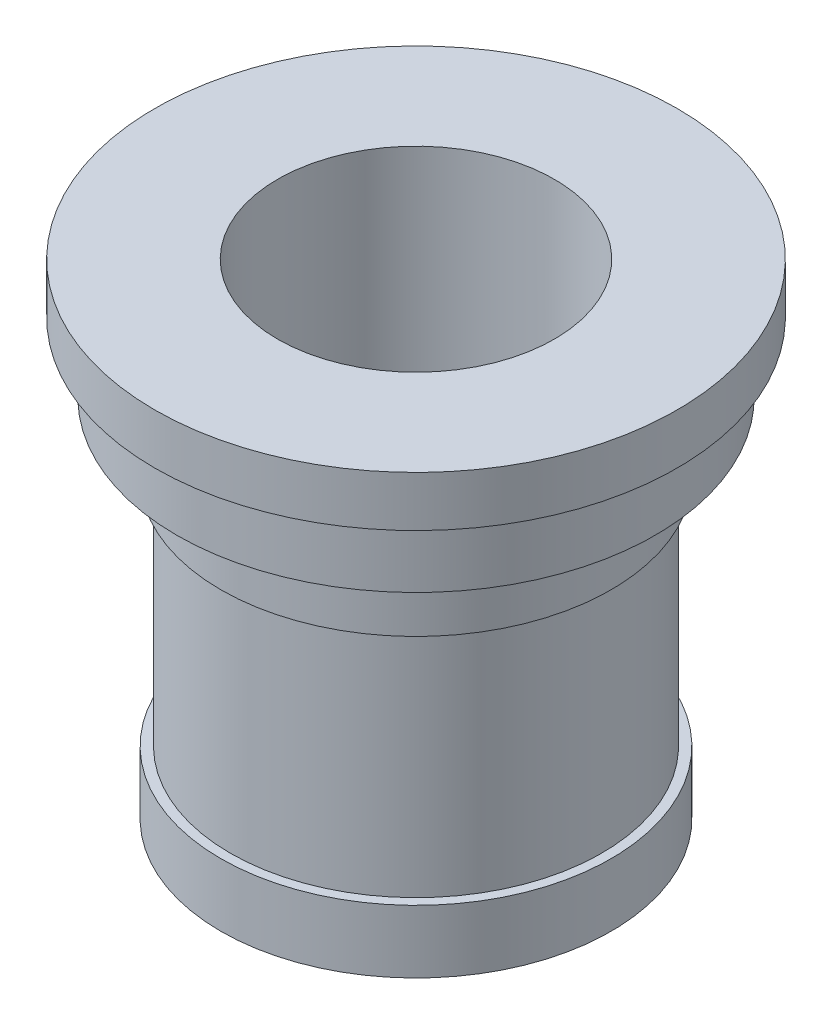
ISO-10303-21;
HEADER;
FILE_DESCRIPTION(('STEP AP214'),'2;1');
FILE_NAME('part.step','',(''),(''),'','','');
FILE_SCHEMA(('AUTOMOTIVE_DESIGN { 1 0 10303 214 1 1 1 1 }'));
ENDSEC;
DATA;
#1=APPLICATION_CONTEXT('core data for automotive mechanical design processes');
#2=APPLICATION_PROTOCOL_DEFINITION('international standard','automotive_design',2000,#1);
#3=PRODUCT_CONTEXT('',#1,'mechanical');
#4=PRODUCT('Part','Part','',(#3));
#5=PRODUCT_RELATED_PRODUCT_CATEGORY('part','',(#4));
#6=PRODUCT_DEFINITION_FORMATION('','',#4);
#7=PRODUCT_DEFINITION_CONTEXT('part definition',#1,'design');
#8=PRODUCT_DEFINITION('design','',#6,#7);
#9=PRODUCT_DEFINITION_SHAPE('','',#8);
#10=(LENGTH_UNIT() NAMED_UNIT(*) SI_UNIT(.MILLI.,.METRE.));
#11=(NAMED_UNIT(*) PLANE_ANGLE_UNIT() SI_UNIT($,.RADIAN.));
#12=(NAMED_UNIT(*) SI_UNIT($,.STERADIAN.) SOLID_ANGLE_UNIT());
#13=UNCERTAINTY_MEASURE_WITH_UNIT(LENGTH_MEASURE(1.E-05),#10,'distance_accuracy_value','');
#14=(GEOMETRIC_REPRESENTATION_CONTEXT(3) GLOBAL_UNCERTAINTY_ASSIGNED_CONTEXT((#13)) GLOBAL_UNIT_ASSIGNED_CONTEXT((#10,
#11,#12)) REPRESENTATION_CONTEXT('',''));
#15=CARTESIAN_POINT('',(0.,0.,0.));
#16=DIRECTION('',(0.,0.,1.));
#17=DIRECTION('',(1.,0.,0.));
#18=AXIS2_PLACEMENT_3D('',#15,#16,#17);
#19=CARTESIAN_POINT('',(0.,0.,0.));
#20=DIRECTION('',(0.,1.,0.));
#21=DIRECTION('',(0.,0.,1.));
#22=AXIS2_PLACEMENT_3D('',#19,#20,#21);
#23=PLANE('',#22);
#24=CARTESIAN_POINT('',(0.,0.,0.));
#25=DIRECTION('',(0.,1.,0.));
#26=DIRECTION('',(0.,0.,1.));
#27=AXIS2_PLACEMENT_3D('',#24,#25,#26);
#28=CIRCLE('',#27,22.);
#29=CARTESIAN_POINT('',(-1.49912810403716,0.,-21.9488636363636));
#30=VERTEX_POINT('',#29);
#31=CARTESIAN_POINT('',(1.49912810403716,0.,-21.9488636363636));
#32=VERTEX_POINT('',#31);
#33=EDGE_CURVE('E84',#30,#32,#28,.T.);
#34=ORIENTED_EDGE('',*,*,#33,.T.);
#35=CARTESIAN_POINT('',(0.,0.,-22.));
#36=DIRECTION('',(0.,-1.,0.));
#37=DIRECTION('',(0.,0.,-1.));
#38=AXIS2_PLACEMENT_3D('',#35,#36,#37);
#39=CIRCLE('',#38,1.5);
#40=EDGE_CURVE('E74',#30,#32,#39,.T.);
#41=ORIENTED_EDGE('',*,*,#40,.F.);
#42=EDGE_LOOP('',(#34,#41));
#43=FACE_BOUND('',#42,.T.);
#44=CARTESIAN_POINT('',(0.,0.,0.));
#45=DIRECTION('',(0.,1.,0.));
#46=DIRECTION('',(0.,0.,1.));
#47=AXIS2_PLACEMENT_3D('',#44,#45,#46);
#48=CIRCLE('',#47,31.);
#49=CARTESIAN_POINT('',(0.,0.,31.));
#50=VERTEX_POINT('',#49);
#51=EDGE_CURVE('E119',#50,#50,#48,.T.);
#52=ORIENTED_EDGE('',*,*,#51,.F.);
#53=EDGE_LOOP('',(#52));
#54=FACE_BOUND('',#53,.T.);
#55=ADVANCED_FACE('F49',(#43,#54),#23,.F.);
#56=CARTESIAN_POINT('',(0.,98.3175182481752,0.));
#57=DIRECTION('',(0.,1.,0.));
#58=DIRECTION('',(0.,0.,1.));
#59=AXIS2_PLACEMENT_3D('',#56,#57,#58);
#60=CYLINDRICAL_SURFACE('',#59,31.);
#61=CARTESIAN_POINT('',(0.,9.99999999999999,0.));
#62=DIRECTION('',(0.,1.,0.));
#63=DIRECTION('',(0.,0.,1.));
#64=AXIS2_PLACEMENT_3D('',#61,#62,#63);
#65=CIRCLE('',#64,31.);
#66=CARTESIAN_POINT('',(0.,9.99999999999999,31.));
#67=VERTEX_POINT('',#66);
#68=EDGE_CURVE('E116',#67,#67,#65,.T.);
#69=ORIENTED_EDGE('',*,*,#68,.F.);
#70=EDGE_LOOP('',(#69));
#71=FACE_BOUND('',#70,.T.);
#72=ORIENTED_EDGE('',*,*,#51,.T.);
#73=EDGE_LOOP('',(#72));
#74=FACE_BOUND('',#73,.T.);
#75=ADVANCED_FACE('F124',(#71,#74),#60,.T.);
#76=CARTESIAN_POINT('',(31.,10.,0.));
#77=DIRECTION('',(0.,-1.,0.));
#78=DIRECTION('',(0.,0.,-1.));
#79=AXIS2_PLACEMENT_3D('',#76,#77,#78);
#80=PLANE('',#79);
#81=CARTESIAN_POINT('',(0.,9.99999999999999,0.));
#82=DIRECTION('',(0.,1.,0.));
#83=DIRECTION('',(0.,0.,1.));
#84=AXIS2_PLACEMENT_3D('',#81,#82,#83);
#85=CIRCLE('',#84,29.5);
#86=CARTESIAN_POINT('',(0.,9.99999999999999,29.5));
#87=VERTEX_POINT('',#86);
#88=EDGE_CURVE('E113',#87,#87,#85,.T.);
#89=ORIENTED_EDGE('',*,*,#88,.F.);
#90=EDGE_LOOP('',(#89));
#91=FACE_BOUND('',#90,.T.);
#92=ORIENTED_EDGE('',*,*,#68,.T.);
#93=EDGE_LOOP('',(#92));
#94=FACE_BOUND('',#93,.T.);
#95=ADVANCED_FACE('F129',(#91,#94),#80,.F.);
#96=CARTESIAN_POINT('',(0.,98.3175182481752,0.));
#97=DIRECTION('',(0.,1.,0.));
#98=DIRECTION('',(0.,0.,1.));
#99=AXIS2_PLACEMENT_3D('',#96,#97,#98);
#100=CYLINDRICAL_SURFACE('',#99,29.5);
#101=CARTESIAN_POINT('',(0.,47.,0.));
#102=DIRECTION('',(0.,1.,0.));
#103=DIRECTION('',(0.,0.,1.));
#104=AXIS2_PLACEMENT_3D('',#101,#102,#103);
#105=CIRCLE('',#104,29.5);
#106=CARTESIAN_POINT('',(0.,47.,29.5));
#107=VERTEX_POINT('',#106);
#108=EDGE_CURVE('E110',#107,#107,#105,.T.);
#109=ORIENTED_EDGE('',*,*,#108,.F.);
#110=EDGE_LOOP('',(#109));
#111=FACE_BOUND('',#110,.T.);
#112=ORIENTED_EDGE('',*,*,#88,.T.);
#113=EDGE_LOOP('',(#112));
#114=FACE_BOUND('',#113,.T.);
#115=ADVANCED_FACE('F134',(#111,#114),#100,.T.);
#116=CARTESIAN_POINT('',(29.5,47.,0.));
#117=DIRECTION('',(0.,1.,0.));
#118=DIRECTION('',(0.,0.,1.));
#119=AXIS2_PLACEMENT_3D('',#116,#117,#118);
#120=PLANE('',#119);
#121=CARTESIAN_POINT('',(0.,47.,0.));
#122=DIRECTION('',(0.,1.,0.));
#123=DIRECTION('',(0.,0.,1.));
#124=AXIS2_PLACEMENT_3D('',#121,#122,#123);
#125=CIRCLE('',#124,31.);
#126=CARTESIAN_POINT('',(0.,47.,31.));
#127=VERTEX_POINT('',#126);
#128=EDGE_CURVE('E107',#127,#127,#125,.T.);
#129=ORIENTED_EDGE('',*,*,#128,.F.);
#130=EDGE_LOOP('',(#129));
#131=FACE_BOUND('',#130,.T.);
#132=ORIENTED_EDGE('',*,*,#108,.T.);
#133=EDGE_LOOP('',(#132));
#134=FACE_BOUND('',#133,.T.);
#135=ADVANCED_FACE('F141',(#131,#134),#120,.F.);
#136=CARTESIAN_POINT('',(0.,98.3175182481752,0.));
#137=DIRECTION('',(0.,1.,0.));
#138=DIRECTION('',(0.,0.,1.));
#139=AXIS2_PLACEMENT_3D('',#136,#137,#138);
#140=CYLINDRICAL_SURFACE('',#139,31.);
#141=CARTESIAN_POINT('',(0.,58.,0.));
#142=DIRECTION('',(0.,1.,0.));
#143=DIRECTION('',(0.,0.,1.));
#144=AXIS2_PLACEMENT_3D('',#141,#142,#143);
#145=CIRCLE('',#144,31.);
#146=CARTESIAN_POINT('',(0.,58.,31.));
#147=VERTEX_POINT('',#146);
#148=EDGE_CURVE('E104',#147,#147,#145,.T.);
#149=ORIENTED_EDGE('',*,*,#148,.F.);
#150=EDGE_LOOP('',(#149));
#151=FACE_BOUND('',#150,.T.);
#152=ORIENTED_EDGE('',*,*,#128,.T.);
#153=EDGE_LOOP('',(#152));
#154=FACE_BOUND('',#153,.T.);
#155=ADVANCED_FACE('F145',(#151,#154),#140,.T.);
#156=CARTESIAN_POINT('',(31.,58.,0.));
#157=DIRECTION('',(0.,1.,0.));
#158=DIRECTION('',(0.,0.,1.));
#159=AXIS2_PLACEMENT_3D('',#156,#157,#158);
#160=PLANE('',#159);
#161=CARTESIAN_POINT('',(0.,58.,0.));
#162=DIRECTION('',(0.,1.,0.));
#163=DIRECTION('',(0.,0.,1.));
#164=AXIS2_PLACEMENT_3D('',#161,#162,#163);
#165=CIRCLE('',#164,38.);
#166=CARTESIAN_POINT('',(0.,58.,38.));
#167=VERTEX_POINT('',#166);
#168=EDGE_CURVE('E101',#167,#167,#165,.T.);
#169=ORIENTED_EDGE('',*,*,#168,.F.);
#170=EDGE_LOOP('',(#169));
#171=FACE_BOUND('',#170,.T.);
#172=ORIENTED_EDGE('',*,*,#148,.T.);
#173=EDGE_LOOP('',(#172));
#174=FACE_BOUND('',#173,.T.);
#175=ADVANCED_FACE('F149',(#171,#174),#160,.F.);
#176=CARTESIAN_POINT('',(0.,98.3175182481752,0.));
#177=DIRECTION('',(0.,1.,0.));
#178=DIRECTION('',(0.,0.,1.));
#179=AXIS2_PLACEMENT_3D('',#176,#177,#178);
#180=CYLINDRICAL_SURFACE('',#179,38.);
#181=CARTESIAN_POINT('',(0.,69.,0.));
#182=DIRECTION('',(0.,1.,0.));
#183=DIRECTION('',(0.,0.,1.));
#184=AXIS2_PLACEMENT_3D('',#181,#182,#183);
#185=CIRCLE('',#184,38.);
#186=CARTESIAN_POINT('',(0.,69.,38.));
#187=VERTEX_POINT('',#186);
#188=EDGE_CURVE('E98',#187,#187,#185,.T.);
#189=ORIENTED_EDGE('',*,*,#188,.F.);
#190=EDGE_LOOP('',(#189));
#191=FACE_BOUND('',#190,.T.);
#192=ORIENTED_EDGE('',*,*,#168,.T.);
#193=EDGE_LOOP('',(#192));
#194=FACE_BOUND('',#193,.T.);
#195=ADVANCED_FACE('F153',(#191,#194),#180,.T.);
#196=CARTESIAN_POINT('',(38.,69.,0.));
#197=DIRECTION('',(0.,1.,0.));
#198=DIRECTION('',(0.,0.,1.));
#199=AXIS2_PLACEMENT_3D('',#196,#197,#198);
#200=PLANE('',#199);
#201=CARTESIAN_POINT('',(0.,69.,0.));
#202=DIRECTION('',(0.,1.,0.));
#203=DIRECTION('',(0.,0.,1.));
#204=AXIS2_PLACEMENT_3D('',#201,#202,#203);
#205=CIRCLE('',#204,41.5);
#206=CARTESIAN_POINT('',(0.,69.,41.5));
#207=VERTEX_POINT('',#206);
#208=EDGE_CURVE('E90',#207,#207,#205,.T.);
#209=ORIENTED_EDGE('',*,*,#208,.F.);
#210=EDGE_LOOP('',(#209));
#211=FACE_BOUND('',#210,.T.);
#212=ORIENTED_EDGE('',*,*,#188,.T.);
#213=EDGE_LOOP('',(#212));
#214=FACE_BOUND('',#213,.T.);
#215=ADVANCED_FACE('F157',(#211,#214),#200,.F.);
#216=CARTESIAN_POINT('',(0.,98.3175182481752,0.));
#217=DIRECTION('',(0.,1.,0.));
#218=DIRECTION('',(0.,0.,1.));
#219=AXIS2_PLACEMENT_3D('',#216,#217,#218);
#220=CYLINDRICAL_SURFACE('',#219,41.5);
#221=CARTESIAN_POINT('',(0.,77.,0.));
#222=DIRECTION('',(0.,1.,0.));
#223=DIRECTION('',(0.,0.,1.));
#224=AXIS2_PLACEMENT_3D('',#221,#222,#223);
#225=CIRCLE('',#224,41.5);
#226=CARTESIAN_POINT('',(0.,77.,41.5));
#227=VERTEX_POINT('',#226);
#228=EDGE_CURVE('E86',#227,#227,#225,.T.);
#229=ORIENTED_EDGE('',*,*,#228,.F.);
#230=EDGE_LOOP('',(#229));
#231=FACE_BOUND('',#230,.T.);
#232=ORIENTED_EDGE('',*,*,#208,.T.);
#233=EDGE_LOOP('',(#232));
#234=FACE_BOUND('',#233,.T.);
#235=ADVANCED_FACE('F161',(#231,#234),#220,.T.);
#236=CARTESIAN_POINT('',(41.5,77.,0.));
#237=DIRECTION('',(0.,-1.,0.));
#238=DIRECTION('',(0.,0.,-1.));
#239=AXIS2_PLACEMENT_3D('',#236,#237,#238);
#240=PLANE('',#239);
#241=CARTESIAN_POINT('',(0.,77.,0.));
#242=DIRECTION('',(0.,1.,0.));
#243=DIRECTION('',(0.,0.,1.));
#244=AXIS2_PLACEMENT_3D('',#241,#242,#243);
#245=CIRCLE('',#244,22.);
#246=CARTESIAN_POINT('',(0.,77.,22.));
#247=VERTEX_POINT('',#246);
#248=EDGE_CURVE('E87',#247,#247,#245,.T.);
#249=ORIENTED_EDGE('',*,*,#248,.F.);
#250=EDGE_LOOP('',(#249));
#251=FACE_BOUND('',#250,.T.);
#252=ORIENTED_EDGE('',*,*,#228,.T.);
#253=EDGE_LOOP('',(#252));
#254=FACE_BOUND('',#253,.T.);
#255=ADVANCED_FACE('F165',(#251,#254),#240,.F.);
#256=CARTESIAN_POINT('',(0.,0.,0.));
#257=DIRECTION('',(0.,1.,0.));
#258=DIRECTION('',(0.,0.,1.));
#259=AXIS2_PLACEMENT_3D('',#256,#257,#258);
#260=CYLINDRICAL_SURFACE('',#259,22.);
#261=ORIENTED_EDGE('',*,*,#33,.F.);
#262=DIRECTION('',(0.,-1.,0.));
#263=VECTOR('',#262,1.);
#264=CARTESIAN_POINT('',(-1.49912810403716,5.,-21.9488636363636));
#265=LINE('',#264,#263);
#266=CARTESIAN_POINT('',(-1.49912810403716,10.,-21.9488636363636));
#267=VERTEX_POINT('',#266);
#268=EDGE_CURVE('E13',#30,#267,#265,.F.);
#269=ORIENTED_EDGE('',*,*,#268,.T.);
#270=CARTESIAN_POINT('',(0.,10.,0.));
#271=DIRECTION('',(0.,-1.,0.));
#272=DIRECTION('',(0.,0.,-1.));
#273=AXIS2_PLACEMENT_3D('',#270,#271,#272);
#274=CIRCLE('',#273,22.);
#275=CARTESIAN_POINT('',(1.49912810403716,10.,-21.9488636363636));
#276=VERTEX_POINT('',#275);
#277=EDGE_CURVE('E66',#276,#267,#274,.F.);
#278=ORIENTED_EDGE('',*,*,#277,.F.);
#279=DIRECTION('',(0.,-1.,0.));
#280=VECTOR('',#279,1.);
#281=CARTESIAN_POINT('',(1.49912810403716,5.,-21.9488636363636));
#282=LINE('',#281,#280);
#283=EDGE_CURVE('E56',#276,#32,#282,.T.);
#284=ORIENTED_EDGE('',*,*,#283,.T.);
#285=EDGE_LOOP('',(#261,#269,#278,#284));
#286=FACE_BOUND('',#285,.T.);
#287=ORIENTED_EDGE('',*,*,#248,.T.);
#288=EDGE_LOOP('',(#287));
#289=FACE_BOUND('',#288,.T.);
#290=ADVANCED_FACE('F82',(#286,#289),#260,.F.);
#291=CARTESIAN_POINT('',(0.,10.,-22.));
#292=DIRECTION('',(0.,-1.,0.));
#293=DIRECTION('',(0.,0.,-1.));
#294=AXIS2_PLACEMENT_3D('',#291,#292,#293);
#295=CYLINDRICAL_SURFACE('',#294,1.5);
#296=ORIENTED_EDGE('',*,*,#40,.T.);
#297=ORIENTED_EDGE('',*,*,#283,.F.);
#298=CARTESIAN_POINT('',(0.,10.,-22.));
#299=DIRECTION('',(0.,-1.,0.));
#300=DIRECTION('',(0.,0.,-1.));
#301=AXIS2_PLACEMENT_3D('',#298,#299,#300);
#302=CIRCLE('',#301,1.5);
#303=EDGE_CURVE('E62',#267,#276,#302,.T.);
#304=ORIENTED_EDGE('',*,*,#303,.F.);
#305=ORIENTED_EDGE('',*,*,#268,.F.);
#306=EDGE_LOOP('',(#296,#297,#304,#305));
#307=FACE_BOUND('',#306,.T.);
#308=ADVANCED_FACE('F76',(#307),#295,.F.);
#309=CARTESIAN_POINT('',(0.,10.,-22.));
#310=DIRECTION('',(0.,-1.,0.));
#311=DIRECTION('',(0.,0.,-1.));
#312=AXIS2_PLACEMENT_3D('',#309,#310,#311);
#313=PLANE('',#312);
#314=ORIENTED_EDGE('',*,*,#277,.T.);
#315=ORIENTED_EDGE('',*,*,#303,.T.);
#316=EDGE_LOOP('',(#314,#315));
#317=FACE_BOUND('',#316,.T.);
#318=ADVANCED_FACE('F174',(#317),#313,.T.);
#319=CLOSED_SHELL('',(#55,#75,#95,#115,#135,#155,#175,#195,#215,#235,#255,#290,#308,#318));
#320=MANIFOLD_SOLID_BREP('B2',#319);
#321=ADVANCED_BREP_SHAPE_REPRESENTATION('',(#18,#320),#14);
#322=SHAPE_DEFINITION_REPRESENTATION(#9,#321);
ENDSEC;
END-ISO-10303-21;
